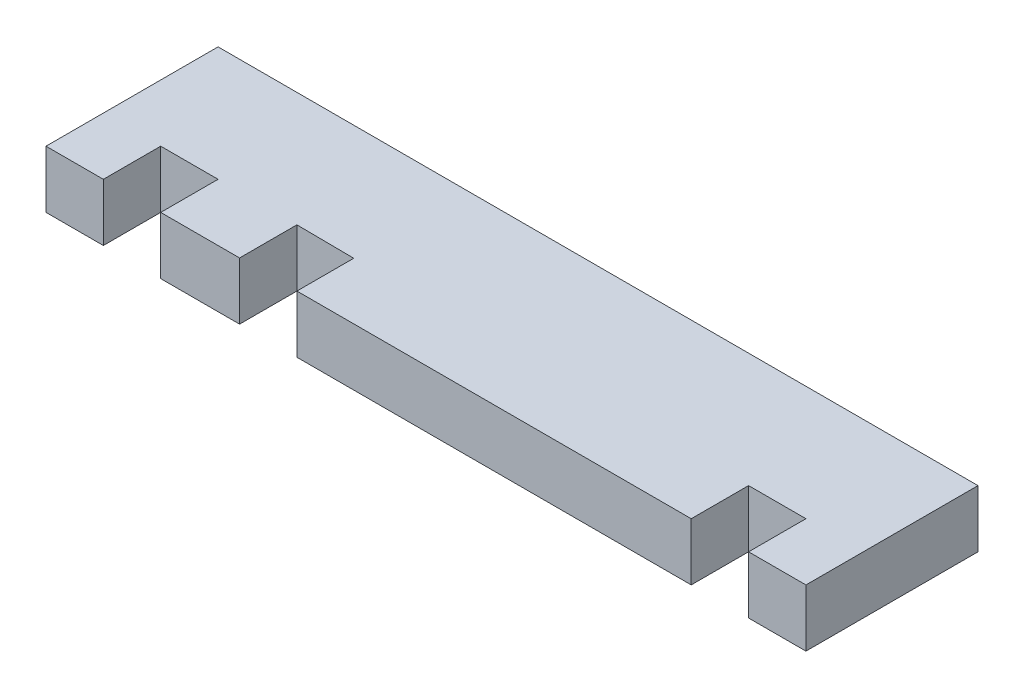
ISO-10303-21;
HEADER;
FILE_DESCRIPTION(('STEP AP214'),'2;1');
FILE_NAME('part.step','',(''),(''),'','','');
FILE_SCHEMA(('AUTOMOTIVE_DESIGN { 1 0 10303 214 1 1 1 1 }'));
ENDSEC;
DATA;
#1=APPLICATION_CONTEXT('core data for automotive mechanical design processes');
#2=APPLICATION_PROTOCOL_DEFINITION('international standard','automotive_design',2000,#1);
#3=PRODUCT_CONTEXT('',#1,'mechanical');
#4=PRODUCT('Part','Part','',(#3));
#5=PRODUCT_RELATED_PRODUCT_CATEGORY('part','',(#4));
#6=PRODUCT_DEFINITION_FORMATION('','',#4);
#7=PRODUCT_DEFINITION_CONTEXT('part definition',#1,'design');
#8=PRODUCT_DEFINITION('design','',#6,#7);
#9=PRODUCT_DEFINITION_SHAPE('','',#8);
#10=(LENGTH_UNIT() NAMED_UNIT(*) SI_UNIT(.MILLI.,.METRE.));
#11=(NAMED_UNIT(*) PLANE_ANGLE_UNIT() SI_UNIT($,.RADIAN.));
#12=(NAMED_UNIT(*) SI_UNIT($,.STERADIAN.) SOLID_ANGLE_UNIT());
#13=UNCERTAINTY_MEASURE_WITH_UNIT(LENGTH_MEASURE(1.E-05),#10,'distance_accuracy_value','');
#14=(GEOMETRIC_REPRESENTATION_CONTEXT(3) GLOBAL_UNCERTAINTY_ASSIGNED_CONTEXT((#13)) GLOBAL_UNIT_ASSIGNED_CONTEXT((#10,
#11,#12)) REPRESENTATION_CONTEXT('',''));
#15=CARTESIAN_POINT('',(0.,0.,0.));
#16=DIRECTION('',(0.,0.,1.));
#17=DIRECTION('',(1.,0.,0.));
#18=AXIS2_PLACEMENT_3D('',#15,#16,#17);
#19=CARTESIAN_POINT('',(26.5,4.,6.));
#20=DIRECTION('',(-1.,0.,0.));
#21=DIRECTION('',(0.,0.,1.));
#22=AXIS2_PLACEMENT_3D('',#19,#20,#21);
#23=PLANE('',#22);
#24=DIRECTION('',(0.,0.,-1.));
#25=VECTOR('',#24,1.);
#26=CARTESIAN_POINT('',(26.5,0.,6.));
#27=LINE('',#26,#25);
#28=CARTESIAN_POINT('',(26.5,0.,6.));
#29=VERTEX_POINT('',#28);
#30=CARTESIAN_POINT('',(26.5,0.,-6.));
#31=VERTEX_POINT('',#30);
#32=EDGE_CURVE('E176',#29,#31,#27,.T.);
#33=ORIENTED_EDGE('',*,*,#32,.T.);
#34=DIRECTION('',(0.,-1.,0.));
#35=VECTOR('',#34,1.);
#36=CARTESIAN_POINT('',(26.5,4.,-6.));
#37=LINE('',#36,#35);
#38=CARTESIAN_POINT('',(26.5,4.,-6.));
#39=VERTEX_POINT('',#38);
#40=EDGE_CURVE('E11',#39,#31,#37,.T.);
#41=ORIENTED_EDGE('',*,*,#40,.F.);
#42=DIRECTION('',(0.,0.,-1.));
#43=VECTOR('',#42,1.);
#44=CARTESIAN_POINT('',(26.5,4.,6.));
#45=LINE('',#44,#43);
#46=CARTESIAN_POINT('',(26.5,4.,6.));
#47=VERTEX_POINT('',#46);
#48=EDGE_CURVE('E206',#47,#39,#45,.T.);
#49=ORIENTED_EDGE('',*,*,#48,.F.);
#50=DIRECTION('',(0.,-1.,0.));
#51=VECTOR('',#50,1.);
#52=CARTESIAN_POINT('',(26.5,4.,6.));
#53=LINE('',#52,#51);
#54=EDGE_CURVE('E172',#47,#29,#53,.T.);
#55=ORIENTED_EDGE('',*,*,#54,.T.);
#56=EDGE_LOOP('',(#33,#41,#49,#55));
#57=FACE_BOUND('',#56,.T.);
#58=ADVANCED_FACE('F32',(#57),#23,.F.);
#59=CARTESIAN_POINT('',(-26.5,4.,-6.));
#60=DIRECTION('',(0.,0.,1.));
#61=DIRECTION('',(1.,0.,0.));
#62=AXIS2_PLACEMENT_3D('',#59,#60,#61);
#63=PLANE('',#62);
#64=DIRECTION('',(-1.,0.,0.));
#65=VECTOR('',#64,1.);
#66=CARTESIAN_POINT('',(-26.5,0.,-6.));
#67=LINE('',#66,#65);
#68=CARTESIAN_POINT('',(-26.5,0.,-6.));
#69=VERTEX_POINT('',#68);
#70=EDGE_CURVE('E179',#31,#69,#67,.T.);
#71=ORIENTED_EDGE('',*,*,#70,.T.);
#72=DIRECTION('',(0.,-1.,0.));
#73=VECTOR('',#72,1.);
#74=CARTESIAN_POINT('',(-26.5,4.,-6.));
#75=LINE('',#74,#73);
#76=CARTESIAN_POINT('',(-26.5,4.,-6.));
#77=VERTEX_POINT('',#76);
#78=EDGE_CURVE('E40',#77,#69,#75,.T.);
#79=ORIENTED_EDGE('',*,*,#78,.F.);
#80=DIRECTION('',(-1.,0.,0.));
#81=VECTOR('',#80,1.);
#82=CARTESIAN_POINT('',(-26.5,4.,-6.));
#83=LINE('',#82,#81);
#84=EDGE_CURVE('E115',#39,#77,#83,.T.);
#85=ORIENTED_EDGE('',*,*,#84,.F.);
#86=ORIENTED_EDGE('',*,*,#40,.T.);
#87=EDGE_LOOP('',(#71,#79,#85,#86));
#88=FACE_BOUND('',#87,.T.);
#89=ADVANCED_FACE('F304',(#88),#63,.F.);
#90=CARTESIAN_POINT('',(-26.5,4.,-6.));
#91=DIRECTION('',(1.,0.,0.));
#92=DIRECTION('',(0.,0.,-1.));
#93=AXIS2_PLACEMENT_3D('',#90,#91,#92);
#94=PLANE('',#93);
#95=DIRECTION('',(0.,0.,1.));
#96=VECTOR('',#95,1.);
#97=CARTESIAN_POINT('',(-26.5,0.,-6.));
#98=LINE('',#97,#96);
#99=CARTESIAN_POINT('',(-26.5,0.,6.));
#100=VERTEX_POINT('',#99);
#101=EDGE_CURVE('E181',#69,#100,#98,.T.);
#102=ORIENTED_EDGE('',*,*,#101,.T.);
#103=DIRECTION('',(0.,-1.,0.));
#104=VECTOR('',#103,1.);
#105=CARTESIAN_POINT('',(-26.5,4.,6.));
#106=LINE('',#105,#104);
#107=CARTESIAN_POINT('',(-26.5,4.,6.));
#108=VERTEX_POINT('',#107);
#109=EDGE_CURVE('E237',#108,#100,#106,.T.);
#110=ORIENTED_EDGE('',*,*,#109,.F.);
#111=DIRECTION('',(0.,0.,1.));
#112=VECTOR('',#111,1.);
#113=CARTESIAN_POINT('',(-26.5,4.,-6.));
#114=LINE('',#113,#112);
#115=EDGE_CURVE('E245',#77,#108,#114,.T.);
#116=ORIENTED_EDGE('',*,*,#115,.F.);
#117=ORIENTED_EDGE('',*,*,#78,.T.);
#118=EDGE_LOOP('',(#102,#110,#116,#117));
#119=FACE_BOUND('',#118,.T.);
#120=ADVANCED_FACE('F243',(#119),#94,.F.);
#121=CARTESIAN_POINT('',(-26.5,4.,6.));
#122=DIRECTION('',(0.,0.,-1.));
#123=DIRECTION('',(-1.,0.,0.));
#124=AXIS2_PLACEMENT_3D('',#121,#122,#123);
#125=PLANE('',#124);
#126=DIRECTION('',(1.,0.,0.));
#127=VECTOR('',#126,1.);
#128=CARTESIAN_POINT('',(-26.5,0.,6.));
#129=LINE('',#128,#127);
#130=CARTESIAN_POINT('',(-22.5,0.,6.));
#131=VERTEX_POINT('',#130);
#132=EDGE_CURVE('E183',#100,#131,#129,.T.);
#133=ORIENTED_EDGE('',*,*,#132,.T.);
#134=DIRECTION('',(0.,-1.,0.));
#135=VECTOR('',#134,1.);
#136=CARTESIAN_POINT('',(-22.5,4.,6.));
#137=LINE('',#136,#135);
#138=CARTESIAN_POINT('',(-22.5,4.,6.));
#139=VERTEX_POINT('',#138);
#140=EDGE_CURVE('E234',#139,#131,#137,.T.);
#141=ORIENTED_EDGE('',*,*,#140,.F.);
#142=DIRECTION('',(1.,0.,0.));
#143=VECTOR('',#142,1.);
#144=CARTESIAN_POINT('',(-26.5,4.,6.));
#145=LINE('',#144,#143);
#146=EDGE_CURVE('E263',#108,#139,#145,.T.);
#147=ORIENTED_EDGE('',*,*,#146,.F.);
#148=ORIENTED_EDGE('',*,*,#109,.T.);
#149=EDGE_LOOP('',(#133,#141,#147,#148));
#150=FACE_BOUND('',#149,.T.);
#151=ADVANCED_FACE('F254',(#150),#125,.F.);
#152=CARTESIAN_POINT('',(-22.5,4.,6.));
#153=DIRECTION('',(-1.,0.,0.));
#154=DIRECTION('',(0.,0.,1.));
#155=AXIS2_PLACEMENT_3D('',#152,#153,#154);
#156=PLANE('',#155);
#157=DIRECTION('',(0.,0.,-1.));
#158=VECTOR('',#157,1.);
#159=CARTESIAN_POINT('',(-22.5,0.,6.));
#160=LINE('',#159,#158);
#161=CARTESIAN_POINT('',(-22.5,0.,2.));
#162=VERTEX_POINT('',#161);
#163=EDGE_CURVE('E185',#131,#162,#160,.T.);
#164=ORIENTED_EDGE('',*,*,#163,.T.);
#165=DIRECTION('',(0.,-1.,0.));
#166=VECTOR('',#165,1.);
#167=CARTESIAN_POINT('',(-22.5,4.,2.));
#168=LINE('',#167,#166);
#169=CARTESIAN_POINT('',(-22.5,4.,2.));
#170=VERTEX_POINT('',#169);
#171=EDGE_CURVE('E231',#170,#162,#168,.T.);
#172=ORIENTED_EDGE('',*,*,#171,.F.);
#173=DIRECTION('',(0.,0.,-1.));
#174=VECTOR('',#173,1.);
#175=CARTESIAN_POINT('',(-22.5,4.,6.));
#176=LINE('',#175,#174);
#177=EDGE_CURVE('E260',#139,#170,#176,.T.);
#178=ORIENTED_EDGE('',*,*,#177,.F.);
#179=ORIENTED_EDGE('',*,*,#140,.T.);
#180=EDGE_LOOP('',(#164,#172,#178,#179));
#181=FACE_BOUND('',#180,.T.);
#182=ADVANCED_FACE('F258',(#181),#156,.F.);
#183=CARTESIAN_POINT('',(-22.5,4.,2.));
#184=DIRECTION('',(0.,0.,-1.));
#185=DIRECTION('',(-1.,0.,0.));
#186=AXIS2_PLACEMENT_3D('',#183,#184,#185);
#187=PLANE('',#186);
#188=DIRECTION('',(1.,0.,0.));
#189=VECTOR('',#188,1.);
#190=CARTESIAN_POINT('',(-22.5,0.,2.));
#191=LINE('',#190,#189);
#192=CARTESIAN_POINT('',(-18.5,0.,2.));
#193=VERTEX_POINT('',#192);
#194=EDGE_CURVE('E187',#162,#193,#191,.T.);
#195=ORIENTED_EDGE('',*,*,#194,.T.);
#196=DIRECTION('',(0.,-1.,0.));
#197=VECTOR('',#196,1.);
#198=CARTESIAN_POINT('',(-18.5,4.,2.));
#199=LINE('',#198,#197);
#200=CARTESIAN_POINT('',(-18.5,4.,2.));
#201=VERTEX_POINT('',#200);
#202=EDGE_CURVE('E228',#201,#193,#199,.T.);
#203=ORIENTED_EDGE('',*,*,#202,.F.);
#204=DIRECTION('',(1.,0.,0.));
#205=VECTOR('',#204,1.);
#206=CARTESIAN_POINT('',(-22.5,4.,2.));
#207=LINE('',#206,#205);
#208=EDGE_CURVE('E262',#170,#201,#207,.T.);
#209=ORIENTED_EDGE('',*,*,#208,.F.);
#210=ORIENTED_EDGE('',*,*,#171,.T.);
#211=EDGE_LOOP('',(#195,#203,#209,#210));
#212=FACE_BOUND('',#211,.T.);
#213=ADVANCED_FACE('F317',(#212),#187,.F.);
#214=CARTESIAN_POINT('',(-18.5,4.,2.));
#215=DIRECTION('',(1.,0.,0.));
#216=DIRECTION('',(0.,0.,-1.));
#217=AXIS2_PLACEMENT_3D('',#214,#215,#216);
#218=PLANE('',#217);
#219=DIRECTION('',(0.,0.,1.));
#220=VECTOR('',#219,1.);
#221=CARTESIAN_POINT('',(-18.5,0.,2.));
#222=LINE('',#221,#220);
#223=CARTESIAN_POINT('',(-18.5,0.,6.));
#224=VERTEX_POINT('',#223);
#225=EDGE_CURVE('E189',#193,#224,#222,.T.);
#226=ORIENTED_EDGE('',*,*,#225,.T.);
#227=DIRECTION('',(0.,-1.,0.));
#228=VECTOR('',#227,1.);
#229=CARTESIAN_POINT('',(-18.5,4.,6.));
#230=LINE('',#229,#228);
#231=CARTESIAN_POINT('',(-18.5,4.,6.));
#232=VERTEX_POINT('',#231);
#233=EDGE_CURVE('E225',#232,#224,#230,.T.);
#234=ORIENTED_EDGE('',*,*,#233,.F.);
#235=DIRECTION('',(0.,0.,1.));
#236=VECTOR('',#235,1.);
#237=CARTESIAN_POINT('',(-18.5,4.,2.));
#238=LINE('',#237,#236);
#239=EDGE_CURVE('E265',#201,#232,#238,.T.);
#240=ORIENTED_EDGE('',*,*,#239,.F.);
#241=ORIENTED_EDGE('',*,*,#202,.T.);
#242=EDGE_LOOP('',(#226,#234,#240,#241));
#243=FACE_BOUND('',#242,.T.);
#244=ADVANCED_FACE('F320',(#243),#218,.F.);
#245=CARTESIAN_POINT('',(-18.5,4.,6.));
#246=DIRECTION('',(0.,0.,-1.));
#247=DIRECTION('',(-1.,0.,0.));
#248=AXIS2_PLACEMENT_3D('',#245,#246,#247);
#249=PLANE('',#248);
#250=DIRECTION('',(1.,0.,0.));
#251=VECTOR('',#250,1.);
#252=CARTESIAN_POINT('',(-18.5,0.,6.));
#253=LINE('',#252,#251);
#254=CARTESIAN_POINT('',(-12.9998219967513,0.,6.));
#255=VERTEX_POINT('',#254);
#256=EDGE_CURVE('E191',#224,#255,#253,.T.);
#257=ORIENTED_EDGE('',*,*,#256,.T.);
#258=DIRECTION('',(0.,-1.,0.));
#259=VECTOR('',#258,1.);
#260=CARTESIAN_POINT('',(-12.9998219967513,4.,6.));
#261=LINE('',#260,#259);
#262=CARTESIAN_POINT('',(-12.9998219967513,4.,6.));
#263=VERTEX_POINT('',#262);
#264=EDGE_CURVE('E222',#263,#255,#261,.T.);
#265=ORIENTED_EDGE('',*,*,#264,.F.);
#266=DIRECTION('',(1.,0.,0.));
#267=VECTOR('',#266,1.);
#268=CARTESIAN_POINT('',(-18.5,4.,6.));
#269=LINE('',#268,#267);
#270=EDGE_CURVE('E271',#232,#263,#269,.T.);
#271=ORIENTED_EDGE('',*,*,#270,.F.);
#272=ORIENTED_EDGE('',*,*,#233,.T.);
#273=EDGE_LOOP('',(#257,#265,#271,#272));
#274=FACE_BOUND('',#273,.T.);
#275=ADVANCED_FACE('F324',(#274),#249,.F.);
#276=CARTESIAN_POINT('',(-12.9998219967513,4.,6.));
#277=DIRECTION('',(-1.,0.,0.));
#278=DIRECTION('',(0.,0.,1.));
#279=AXIS2_PLACEMENT_3D('',#276,#277,#278);
#280=PLANE('',#279);
#281=DIRECTION('',(0.,0.,-1.));
#282=VECTOR('',#281,1.);
#283=CARTESIAN_POINT('',(-12.9998219967513,0.,6.));
#284=LINE('',#283,#282);
#285=CARTESIAN_POINT('',(-12.9998219967513,0.,2.));
#286=VERTEX_POINT('',#285);
#287=EDGE_CURVE('E193',#255,#286,#284,.T.);
#288=ORIENTED_EDGE('',*,*,#287,.T.);
#289=DIRECTION('',(0.,-1.,0.));
#290=VECTOR('',#289,1.);
#291=CARTESIAN_POINT('',(-12.9998219967513,4.,2.));
#292=LINE('',#291,#290);
#293=CARTESIAN_POINT('',(-12.9998219967513,4.,2.));
#294=VERTEX_POINT('',#293);
#295=EDGE_CURVE('E219',#294,#286,#292,.T.);
#296=ORIENTED_EDGE('',*,*,#295,.F.);
#297=DIRECTION('',(0.,0.,-1.));
#298=VECTOR('',#297,1.);
#299=CARTESIAN_POINT('',(-12.9998219967513,4.,6.));
#300=LINE('',#299,#298);
#301=EDGE_CURVE('E273',#263,#294,#300,.T.);
#302=ORIENTED_EDGE('',*,*,#301,.F.);
#303=ORIENTED_EDGE('',*,*,#264,.T.);
#304=EDGE_LOOP('',(#288,#296,#302,#303));
#305=FACE_BOUND('',#304,.T.);
#306=ADVANCED_FACE('F328',(#305),#280,.F.);
#307=CARTESIAN_POINT('',(-12.9998219967513,4.,2.));
#308=DIRECTION('',(0.00943396226415062,0.,-0.999955499187838));
#309=DIRECTION('',(-0.999955499187838,0.,-0.00943396226415062));
#310=AXIS2_PLACEMENT_3D('',#307,#308,#309);
#311=PLANE('',#310);
#312=DIRECTION('',(0.999955499187838,0.,0.00943396226415062));
#313=VECTOR('',#312,1.);
#314=CARTESIAN_POINT('',(-12.9998219967513,0.,2.));
#315=LINE('',#314,#313);
#316=CARTESIAN_POINT('',(-8.99999999999998,0.,2.0377358490566));
#317=VERTEX_POINT('',#316);
#318=EDGE_CURVE('E195',#286,#317,#315,.T.);
#319=ORIENTED_EDGE('',*,*,#318,.T.);
#320=DIRECTION('',(0.,-1.,0.));
#321=VECTOR('',#320,1.);
#322=CARTESIAN_POINT('',(-8.99999999999998,4.,2.0377358490566));
#323=LINE('',#322,#321);
#324=CARTESIAN_POINT('',(-8.99999999999998,4.,2.0377358490566));
#325=VERTEX_POINT('',#324);
#326=EDGE_CURVE('E216',#325,#317,#323,.T.);
#327=ORIENTED_EDGE('',*,*,#326,.F.);
#328=DIRECTION('',(0.999955499187838,0.,0.00943396226415062));
#329=VECTOR('',#328,1.);
#330=CARTESIAN_POINT('',(-12.9998219967513,4.,2.));
#331=LINE('',#330,#329);
#332=EDGE_CURVE('E275',#294,#325,#331,.T.);
#333=ORIENTED_EDGE('',*,*,#332,.F.);
#334=ORIENTED_EDGE('',*,*,#295,.T.);
#335=EDGE_LOOP('',(#319,#327,#333,#334));
#336=FACE_BOUND('',#335,.T.);
#337=ADVANCED_FACE('F332',(#336),#311,.F.);
#338=CARTESIAN_POINT('',(-8.99999999999998,4.,2.0377358490566));
#339=DIRECTION('',(1.,0.,0.));
#340=DIRECTION('',(0.,0.,-1.));
#341=AXIS2_PLACEMENT_3D('',#338,#339,#340);
#342=PLANE('',#341);
#343=DIRECTION('',(0.,0.,1.));
#344=VECTOR('',#343,1.);
#345=CARTESIAN_POINT('',(-8.99999999999998,0.,2.0377358490566));
#346=LINE('',#345,#344);
#347=CARTESIAN_POINT('',(-8.99999999999998,0.,6.));
#348=VERTEX_POINT('',#347);
#349=EDGE_CURVE('E197',#317,#348,#346,.T.);
#350=ORIENTED_EDGE('',*,*,#349,.T.);
#351=DIRECTION('',(0.,-1.,0.));
#352=VECTOR('',#351,1.);
#353=CARTESIAN_POINT('',(-8.99999999999998,4.,6.));
#354=LINE('',#353,#352);
#355=CARTESIAN_POINT('',(-8.99999999999998,4.,6.));
#356=VERTEX_POINT('',#355);
#357=EDGE_CURVE('E213',#356,#348,#354,.T.);
#358=ORIENTED_EDGE('',*,*,#357,.F.);
#359=DIRECTION('',(0.,0.,1.));
#360=VECTOR('',#359,1.);
#361=CARTESIAN_POINT('',(-8.99999999999998,4.,2.0377358490566));
#362=LINE('',#361,#360);
#363=EDGE_CURVE('E277',#325,#356,#362,.T.);
#364=ORIENTED_EDGE('',*,*,#363,.F.);
#365=ORIENTED_EDGE('',*,*,#326,.T.);
#366=EDGE_LOOP('',(#350,#358,#364,#365));
#367=FACE_BOUND('',#366,.T.);
#368=ADVANCED_FACE('F336',(#367),#342,.F.);
#369=CARTESIAN_POINT('',(18.5,4.,6.));
#370=DIRECTION('',(0.,0.,-1.));
#371=DIRECTION('',(-1.,0.,0.));
#372=AXIS2_PLACEMENT_3D('',#369,#370,#371);
#373=PLANE('',#372);
#374=DIRECTION('',(1.,0.,0.));
#375=VECTOR('',#374,1.);
#376=CARTESIAN_POINT('',(18.5,0.,6.));
#377=LINE('',#376,#375);
#378=CARTESIAN_POINT('',(18.5,0.,6.));
#379=VERTEX_POINT('',#378);
#380=EDGE_CURVE('E199',#348,#379,#377,.T.);
#381=ORIENTED_EDGE('',*,*,#380,.T.);
#382=DIRECTION('',(0.,-1.,0.));
#383=VECTOR('',#382,1.);
#384=CARTESIAN_POINT('',(18.5,4.,6.));
#385=LINE('',#384,#383);
#386=CARTESIAN_POINT('',(18.5,4.,6.));
#387=VERTEX_POINT('',#386);
#388=EDGE_CURVE('E210',#387,#379,#385,.T.);
#389=ORIENTED_EDGE('',*,*,#388,.F.);
#390=DIRECTION('',(1.,0.,0.));
#391=VECTOR('',#390,1.);
#392=CARTESIAN_POINT('',(18.5,4.,6.));
#393=LINE('',#392,#391);
#394=EDGE_CURVE('E279',#356,#387,#393,.T.);
#395=ORIENTED_EDGE('',*,*,#394,.F.);
#396=ORIENTED_EDGE('',*,*,#357,.T.);
#397=EDGE_LOOP('',(#381,#389,#395,#396));
#398=FACE_BOUND('',#397,.T.);
#399=ADVANCED_FACE('F285',(#398),#373,.F.);
#400=CARTESIAN_POINT('',(18.5,4.,6.));
#401=DIRECTION('',(-1.,0.,0.));
#402=DIRECTION('',(0.,0.,1.));
#403=AXIS2_PLACEMENT_3D('',#400,#401,#402);
#404=PLANE('',#403);
#405=DIRECTION('',(0.,0.,-1.));
#406=VECTOR('',#405,1.);
#407=CARTESIAN_POINT('',(18.5,0.,6.));
#408=LINE('',#407,#406);
#409=CARTESIAN_POINT('',(18.5,0.,2.));
#410=VERTEX_POINT('',#409);
#411=EDGE_CURVE('E201',#379,#410,#408,.T.);
#412=ORIENTED_EDGE('',*,*,#411,.T.);
#413=DIRECTION('',(0.,-1.,0.));
#414=VECTOR('',#413,1.);
#415=CARTESIAN_POINT('',(18.5,4.,2.));
#416=LINE('',#415,#414);
#417=CARTESIAN_POINT('',(18.5,4.,2.));
#418=VERTEX_POINT('',#417);
#419=EDGE_CURVE('E167',#418,#410,#416,.T.);
#420=ORIENTED_EDGE('',*,*,#419,.F.);
#421=DIRECTION('',(0.,0.,-1.));
#422=VECTOR('',#421,1.);
#423=CARTESIAN_POINT('',(18.5,4.,6.));
#424=LINE('',#423,#422);
#425=EDGE_CURVE('E158',#387,#418,#424,.T.);
#426=ORIENTED_EDGE('',*,*,#425,.F.);
#427=ORIENTED_EDGE('',*,*,#388,.T.);
#428=EDGE_LOOP('',(#412,#420,#426,#427));
#429=FACE_BOUND('',#428,.T.);
#430=ADVANCED_FACE('F289',(#429),#404,.F.);
#431=CARTESIAN_POINT('',(18.5,4.,2.));
#432=DIRECTION('',(0.,0.,-1.));
#433=DIRECTION('',(-1.,0.,0.));
#434=AXIS2_PLACEMENT_3D('',#431,#432,#433);
#435=PLANE('',#434);
#436=DIRECTION('',(1.,0.,0.));
#437=VECTOR('',#436,1.);
#438=CARTESIAN_POINT('',(18.5,0.,2.));
#439=LINE('',#438,#437);
#440=CARTESIAN_POINT('',(22.5,0.,2.));
#441=VERTEX_POINT('',#440);
#442=EDGE_CURVE('E166',#410,#441,#439,.T.);
#443=ORIENTED_EDGE('',*,*,#442,.T.);
#444=DIRECTION('',(0.,-1.,0.));
#445=VECTOR('',#444,1.);
#446=CARTESIAN_POINT('',(22.5,4.,2.));
#447=LINE('',#446,#445);
#448=CARTESIAN_POINT('',(22.5,4.,2.));
#449=VERTEX_POINT('',#448);
#450=EDGE_CURVE('E163',#449,#441,#447,.T.);
#451=ORIENTED_EDGE('',*,*,#450,.F.);
#452=DIRECTION('',(1.,0.,0.));
#453=VECTOR('',#452,1.);
#454=CARTESIAN_POINT('',(18.5,4.,2.));
#455=LINE('',#454,#453);
#456=EDGE_CURVE('E152',#418,#449,#455,.T.);
#457=ORIENTED_EDGE('',*,*,#456,.F.);
#458=ORIENTED_EDGE('',*,*,#419,.T.);
#459=EDGE_LOOP('',(#443,#451,#457,#458));
#460=FACE_BOUND('',#459,.T.);
#461=ADVANCED_FACE('F164',(#460),#435,.F.);
#462=CARTESIAN_POINT('',(22.5,4.,2.));
#463=DIRECTION('',(1.,0.,0.));
#464=DIRECTION('',(0.,0.,-1.));
#465=AXIS2_PLACEMENT_3D('',#462,#463,#464);
#466=PLANE('',#465);
#467=DIRECTION('',(0.,0.,1.));
#468=VECTOR('',#467,1.);
#469=CARTESIAN_POINT('',(22.5,0.,2.));
#470=LINE('',#469,#468);
#471=CARTESIAN_POINT('',(22.5,0.,6.));
#472=VERTEX_POINT('',#471);
#473=EDGE_CURVE('E101',#441,#472,#470,.T.);
#474=ORIENTED_EDGE('',*,*,#473,.T.);
#475=DIRECTION('',(0.,-1.,0.));
#476=VECTOR('',#475,1.);
#477=CARTESIAN_POINT('',(22.5,4.,6.));
#478=LINE('',#477,#476);
#479=CARTESIAN_POINT('',(22.5,4.,6.));
#480=VERTEX_POINT('',#479);
#481=EDGE_CURVE('E168',#480,#472,#478,.T.);
#482=ORIENTED_EDGE('',*,*,#481,.F.);
#483=DIRECTION('',(0.,0.,1.));
#484=VECTOR('',#483,1.);
#485=CARTESIAN_POINT('',(22.5,4.,2.));
#486=LINE('',#485,#484);
#487=EDGE_CURVE('E156',#449,#480,#486,.T.);
#488=ORIENTED_EDGE('',*,*,#487,.F.);
#489=ORIENTED_EDGE('',*,*,#450,.T.);
#490=EDGE_LOOP('',(#474,#482,#488,#489));
#491=FACE_BOUND('',#490,.T.);
#492=ADVANCED_FACE('F170',(#491),#466,.F.);
#493=CARTESIAN_POINT('',(22.5,4.,6.));
#494=DIRECTION('',(0.,0.,-1.));
#495=DIRECTION('',(-1.,0.,0.));
#496=AXIS2_PLACEMENT_3D('',#493,#494,#495);
#497=PLANE('',#496);
#498=DIRECTION('',(1.,0.,0.));
#499=VECTOR('',#498,1.);
#500=CARTESIAN_POINT('',(22.5,0.,6.));
#501=LINE('',#500,#499);
#502=EDGE_CURVE('E107',#472,#29,#501,.T.);
#503=ORIENTED_EDGE('',*,*,#502,.T.);
#504=ORIENTED_EDGE('',*,*,#54,.F.);
#505=DIRECTION('',(1.,0.,0.));
#506=VECTOR('',#505,1.);
#507=CARTESIAN_POINT('',(22.5,4.,6.));
#508=LINE('',#507,#506);
#509=EDGE_CURVE('E48',#480,#47,#508,.T.);
#510=ORIENTED_EDGE('',*,*,#509,.F.);
#511=ORIENTED_EDGE('',*,*,#481,.T.);
#512=EDGE_LOOP('',(#503,#504,#510,#511));
#513=FACE_BOUND('',#512,.T.);
#514=ADVANCED_FACE('F293',(#513),#497,.F.);
#515=CARTESIAN_POINT('',(0.,4.,0.));
#516=DIRECTION('',(0.,-1.,0.));
#517=DIRECTION('',(0.,0.,-1.));
#518=AXIS2_PLACEMENT_3D('',#515,#516,#517);
#519=PLANE('',#518);
#520=ORIENTED_EDGE('',*,*,#48,.T.);
#521=ORIENTED_EDGE('',*,*,#84,.T.);
#522=ORIENTED_EDGE('',*,*,#115,.T.);
#523=ORIENTED_EDGE('',*,*,#146,.T.);
#524=ORIENTED_EDGE('',*,*,#177,.T.);
#525=ORIENTED_EDGE('',*,*,#208,.T.);
#526=ORIENTED_EDGE('',*,*,#239,.T.);
#527=ORIENTED_EDGE('',*,*,#270,.T.);
#528=ORIENTED_EDGE('',*,*,#301,.T.);
#529=ORIENTED_EDGE('',*,*,#332,.T.);
#530=ORIENTED_EDGE('',*,*,#363,.T.);
#531=ORIENTED_EDGE('',*,*,#394,.T.);
#532=ORIENTED_EDGE('',*,*,#425,.T.);
#533=ORIENTED_EDGE('',*,*,#456,.T.);
#534=ORIENTED_EDGE('',*,*,#487,.T.);
#535=ORIENTED_EDGE('',*,*,#509,.T.);
#536=EDGE_LOOP('',(#520,#521,#522,#523,#524,#525,#526,#527,#528,#529,#530,#531,#532,#533,#534,#535));
#537=FACE_BOUND('',#536,.T.);
#538=ADVANCED_FACE('F154',(#537),#519,.F.);
#539=CARTESIAN_POINT('',(0.,0.,0.));
#540=DIRECTION('',(0.,-1.,0.));
#541=DIRECTION('',(0.,0.,-1.));
#542=AXIS2_PLACEMENT_3D('',#539,#540,#541);
#543=PLANE('',#542);
#544=ORIENTED_EDGE('',*,*,#32,.F.);
#545=ORIENTED_EDGE('',*,*,#502,.F.);
#546=ORIENTED_EDGE('',*,*,#473,.F.);
#547=ORIENTED_EDGE('',*,*,#442,.F.);
#548=ORIENTED_EDGE('',*,*,#411,.F.);
#549=ORIENTED_EDGE('',*,*,#380,.F.);
#550=ORIENTED_EDGE('',*,*,#349,.F.);
#551=ORIENTED_EDGE('',*,*,#318,.F.);
#552=ORIENTED_EDGE('',*,*,#287,.F.);
#553=ORIENTED_EDGE('',*,*,#256,.F.);
#554=ORIENTED_EDGE('',*,*,#225,.F.);
#555=ORIENTED_EDGE('',*,*,#194,.F.);
#556=ORIENTED_EDGE('',*,*,#163,.F.);
#557=ORIENTED_EDGE('',*,*,#132,.F.);
#558=ORIENTED_EDGE('',*,*,#101,.F.);
#559=ORIENTED_EDGE('',*,*,#70,.F.);
#560=EDGE_LOOP('',(#544,#545,#546,#547,#548,#549,#550,#551,#552,#553,#554,#555,#556,#557,#558,#559));
#561=FACE_BOUND('',#560,.T.);
#562=ADVANCED_FACE('F249',(#561),#543,.T.);
#563=CLOSED_SHELL('',(#58,#89,#120,#151,#182,#213,#244,#275,#306,#337,#368,#399,#430,#461,#492,
#514,#538,#562));
#564=MANIFOLD_SOLID_BREP('B2',#563);
#565=ADVANCED_BREP_SHAPE_REPRESENTATION('',(#18,#564),#14);
#566=SHAPE_DEFINITION_REPRESENTATION(#9,#565);
ENDSEC;
END-ISO-10303-21;
